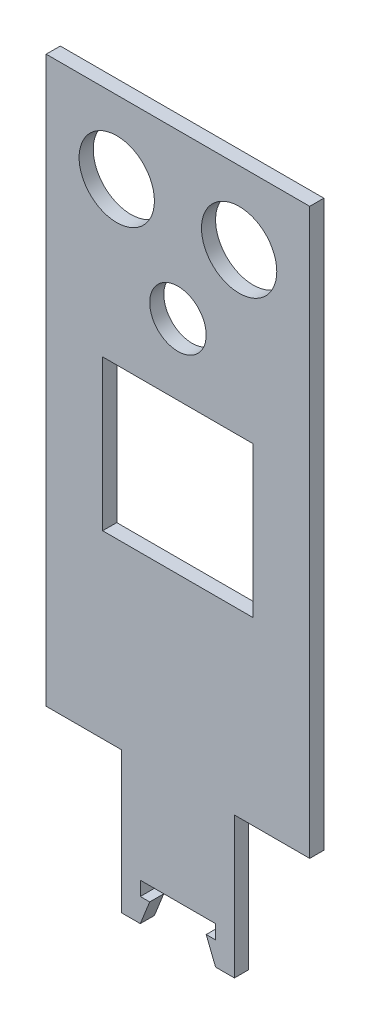
ISO-10303-21;
HEADER;
FILE_DESCRIPTION(('STEP AP214'),'2;1');
FILE_NAME('part.step','',(''),(''),'','','');
FILE_SCHEMA(('AUTOMOTIVE_DESIGN { 1 0 10303 214 1 1 1 1 }'));
ENDSEC;
DATA;
#1=APPLICATION_CONTEXT('core data for automotive mechanical design processes');
#2=APPLICATION_PROTOCOL_DEFINITION('international standard','automotive_design',2000,#1);
#3=PRODUCT_CONTEXT('',#1,'mechanical');
#4=PRODUCT('Part','Part','',(#3));
#5=PRODUCT_RELATED_PRODUCT_CATEGORY('part','',(#4));
#6=PRODUCT_DEFINITION_FORMATION('','',#4);
#7=PRODUCT_DEFINITION_CONTEXT('part definition',#1,'design');
#8=PRODUCT_DEFINITION('design','',#6,#7);
#9=PRODUCT_DEFINITION_SHAPE('','',#8);
#10=(LENGTH_UNIT() NAMED_UNIT(*) SI_UNIT(.MILLI.,.METRE.));
#11=(NAMED_UNIT(*) PLANE_ANGLE_UNIT() SI_UNIT($,.RADIAN.));
#12=(NAMED_UNIT(*) SI_UNIT($,.STERADIAN.) SOLID_ANGLE_UNIT());
#13=UNCERTAINTY_MEASURE_WITH_UNIT(LENGTH_MEASURE(1.E-05),#10,'distance_accuracy_value','');
#14=(GEOMETRIC_REPRESENTATION_CONTEXT(3) GLOBAL_UNCERTAINTY_ASSIGNED_CONTEXT((#13)) GLOBAL_UNIT_ASSIGNED_CONTEXT((#10,
#11,#12)) REPRESENTATION_CONTEXT('',''));
#15=CARTESIAN_POINT('',(0.,0.,0.));
#16=DIRECTION('',(0.,0.,1.));
#17=DIRECTION('',(1.,0.,0.));
#18=AXIS2_PLACEMENT_3D('',#15,#16,#17);
#19=CARTESIAN_POINT('',(0.,0.,3.));
#20=DIRECTION('',(0.,0.,1.));
#21=DIRECTION('',(1.,0.,0.));
#22=AXIS2_PLACEMENT_3D('',#19,#20,#21);
#23=PLANE('',#22);
#24=CARTESIAN_POINT('',(-22.41749108736,76.63301660672,3.));
#25=DIRECTION('',(0.,0.,1.));
#26=DIRECTION('',(1.,0.,0.));
#27=AXIS2_PLACEMENT_3D('',#24,#25,#26);
#28=CIRCLE('',#27,8.);
#29=CARTESIAN_POINT('',(-14.41749108736,76.63301660672,3.));
#30=VERTEX_POINT('',#29);
#31=EDGE_CURVE('E212',#30,#30,#28,.T.);
#32=ORIENTED_EDGE('',*,*,#31,.F.);
#33=EDGE_LOOP('',(#32));
#34=FACE_BOUND('',#33,.T.);
#35=DIRECTION('',(-1.,0.,0.));
#36=VECTOR('',#35,1.);
#37=CARTESIAN_POINT('',(18.58250891264,92.13301660672,3.));
#38=LINE('',#37,#36);
#39=CARTESIAN_POINT('',(18.58250891264,92.13301660672,3.));
#40=VERTEX_POINT('',#39);
#41=CARTESIAN_POINT('',(-37.41749108736,92.13301660672,3.));
#42=VERTEX_POINT('',#41);
#43=EDGE_CURVE('E224',#40,#42,#38,.T.);
#44=ORIENTED_EDGE('',*,*,#43,.T.);
#45=DIRECTION('',(0.,-1.,0.));
#46=VECTOR('',#45,1.);
#47=CARTESIAN_POINT('',(-37.41749108736,92.13301660672,3.));
#48=LINE('',#47,#46);
#49=CARTESIAN_POINT('',(-37.41749108736,-27.86698339328,3.));
#50=VERTEX_POINT('',#49);
#51=EDGE_CURVE('E227',#42,#50,#48,.T.);
#52=ORIENTED_EDGE('',*,*,#51,.T.);
#53=DIRECTION('',(1.,0.,0.));
#54=VECTOR('',#53,1.);
#55=CARTESIAN_POINT('',(-37.41749108736,-27.86698339328,3.));
#56=LINE('',#55,#54);
#57=CARTESIAN_POINT('',(-21.4174910873601,-27.86698339328,3.));
#58=VERTEX_POINT('',#57);
#59=EDGE_CURVE('E230',#50,#58,#56,.T.);
#60=ORIENTED_EDGE('',*,*,#59,.T.);
#61=DIRECTION('',(0.,-1.,0.));
#62=VECTOR('',#61,1.);
#63=CARTESIAN_POINT('',(-21.4174910873601,-27.86698339328,3.));
#64=LINE('',#63,#62);
#65=CARTESIAN_POINT('',(-21.4174910873601,-57.86698339328,3.));
#66=VERTEX_POINT('',#65);
#67=EDGE_CURVE('E232',#58,#66,#64,.T.);
#68=ORIENTED_EDGE('',*,*,#67,.T.);
#69=DIRECTION('',(1.,0.,0.));
#70=VECTOR('',#69,1.);
#71=CARTESIAN_POINT('',(-21.4174910873601,-57.86698339328,3.));
#72=LINE('',#71,#70);
#73=CARTESIAN_POINT('',(-17.4174910873601,-57.86698339328,3.));
#74=VERTEX_POINT('',#73);
#75=EDGE_CURVE('E234',#66,#74,#72,.T.);
#76=ORIENTED_EDGE('',*,*,#75,.T.);
#77=DIRECTION('',(0.371390676354104,0.928476690885259,0.));
#78=VECTOR('',#77,1.);
#79=CARTESIAN_POINT('',(-17.4174910873601,-57.86698339328,3.));
#80=LINE('',#79,#78);
#81=CARTESIAN_POINT('',(-15.41749108736,-52.86698339328,3.));
#82=VERTEX_POINT('',#81);
#83=EDGE_CURVE('E236',#74,#82,#80,.T.);
#84=ORIENTED_EDGE('',*,*,#83,.T.);
#85=DIRECTION('',(-1.,0.,0.));
#86=VECTOR('',#85,1.);
#87=CARTESIAN_POINT('',(-15.41749108736,-52.86698339328,3.));
#88=LINE('',#87,#86);
#89=CARTESIAN_POINT('',(-17.4174910873601,-52.86698339328,3.));
#90=VERTEX_POINT('',#89);
#91=EDGE_CURVE('E238',#82,#90,#88,.T.);
#92=ORIENTED_EDGE('',*,*,#91,.T.);
#93=DIRECTION('',(0.,1.,0.));
#94=VECTOR('',#93,1.);
#95=CARTESIAN_POINT('',(-17.4174910873601,-52.86698339328,3.));
#96=LINE('',#95,#94);
#97=CARTESIAN_POINT('',(-17.4174910873601,-49.86698339328,3.));
#98=VERTEX_POINT('',#97);
#99=EDGE_CURVE('E240',#90,#98,#96,.T.);
#100=ORIENTED_EDGE('',*,*,#99,.T.);
#101=DIRECTION('',(1.,0.,0.));
#102=VECTOR('',#101,1.);
#103=CARTESIAN_POINT('',(-17.4174910873601,-49.86698339328,3.));
#104=LINE('',#103,#102);
#105=CARTESIAN_POINT('',(-1.41749108736005,-49.86698339328,3.));
#106=VERTEX_POINT('',#105);
#107=EDGE_CURVE('E242',#98,#106,#104,.T.);
#108=ORIENTED_EDGE('',*,*,#107,.T.);
#109=DIRECTION('',(0.,-1.,0.));
#110=VECTOR('',#109,1.);
#111=CARTESIAN_POINT('',(-1.41749108736005,-49.86698339328,3.));
#112=LINE('',#111,#110);
#113=CARTESIAN_POINT('',(-1.41749108736005,-52.86698339328,3.));
#114=VERTEX_POINT('',#113);
#115=EDGE_CURVE('E244',#106,#114,#112,.T.);
#116=ORIENTED_EDGE('',*,*,#115,.T.);
#117=DIRECTION('',(-1.,0.,0.));
#118=VECTOR('',#117,1.);
#119=CARTESIAN_POINT('',(-1.41749108736005,-52.86698339328,3.));
#120=LINE('',#119,#118);
#121=CARTESIAN_POINT('',(-3.41749108736005,-52.86698339328,3.));
#122=VERTEX_POINT('',#121);
#123=EDGE_CURVE('E246',#114,#122,#120,.T.);
#124=ORIENTED_EDGE('',*,*,#123,.T.);
#125=DIRECTION('',(0.371390676354104,-0.928476690885259,0.));
#126=VECTOR('',#125,1.);
#127=CARTESIAN_POINT('',(-3.41749108736005,-52.86698339328,3.));
#128=LINE('',#127,#126);
#129=CARTESIAN_POINT('',(-1.41749108736005,-57.86698339328,3.));
#130=VERTEX_POINT('',#129);
#131=EDGE_CURVE('E248',#122,#130,#128,.T.);
#132=ORIENTED_EDGE('',*,*,#131,.T.);
#133=DIRECTION('',(1.,0.,0.));
#134=VECTOR('',#133,1.);
#135=CARTESIAN_POINT('',(-1.41749108736005,-57.86698339328,3.));
#136=LINE('',#135,#134);
#137=CARTESIAN_POINT('',(2.58250891263995,-57.86698339328,3.));
#138=VERTEX_POINT('',#137);
#139=EDGE_CURVE('E250',#130,#138,#136,.T.);
#140=ORIENTED_EDGE('',*,*,#139,.T.);
#141=DIRECTION('',(0.,1.,0.));
#142=VECTOR('',#141,1.);
#143=CARTESIAN_POINT('',(2.58250891263995,-57.86698339328,3.));
#144=LINE('',#143,#142);
#145=CARTESIAN_POINT('',(2.58250891263995,-27.86698339328,3.));
#146=VERTEX_POINT('',#145);
#147=EDGE_CURVE('E252',#138,#146,#144,.T.);
#148=ORIENTED_EDGE('',*,*,#147,.T.);
#149=DIRECTION('',(1.,0.,0.));
#150=VECTOR('',#149,1.);
#151=CARTESIAN_POINT('',(2.58250891263995,-27.86698339328,3.));
#152=LINE('',#151,#150);
#153=CARTESIAN_POINT('',(18.58250891264,-27.86698339328,3.));
#154=VERTEX_POINT('',#153);
#155=EDGE_CURVE('E254',#146,#154,#152,.T.);
#156=ORIENTED_EDGE('',*,*,#155,.T.);
#157=DIRECTION('',(0.,1.,0.));
#158=VECTOR('',#157,1.);
#159=CARTESIAN_POINT('',(18.58250891264,92.13301660672,3.));
#160=LINE('',#159,#158);
#161=EDGE_CURVE('E256',#154,#40,#160,.T.);
#162=ORIENTED_EDGE('',*,*,#161,.T.);
#163=EDGE_LOOP('',(#44,#52,#60,#68,#76,#84,#92,#100,#108,#116,#124,#132,#140,#148,#156,#162));
#164=FACE_BOUND('',#163,.T.);
#165=CARTESIAN_POINT('',(-9.41749108736005,57.43301660672,3.));
#166=DIRECTION('',(0.,0.,1.));
#167=DIRECTION('',(1.,0.,0.));
#168=AXIS2_PLACEMENT_3D('',#165,#166,#167);
#169=CIRCLE('',#168,6.);
#170=CARTESIAN_POINT('',(-3.41749108736005,57.43301660672,3.));
#171=VERTEX_POINT('',#170);
#172=EDGE_CURVE('E218',#171,#171,#169,.T.);
#173=ORIENTED_EDGE('',*,*,#172,.F.);
#174=EDGE_LOOP('',(#173));
#175=FACE_BOUND('',#174,.T.);
#176=CARTESIAN_POINT('',(3.58250891263995,76.63301660672,3.));
#177=DIRECTION('',(0.,0.,1.));
#178=DIRECTION('',(1.,0.,0.));
#179=AXIS2_PLACEMENT_3D('',#176,#177,#178);
#180=CIRCLE('',#179,8.);
#181=CARTESIAN_POINT('',(11.58250891264,76.63301660672,3.));
#182=VERTEX_POINT('',#181);
#183=EDGE_CURVE('E206',#182,#182,#180,.T.);
#184=ORIENTED_EDGE('',*,*,#183,.F.);
#185=EDGE_LOOP('',(#184));
#186=FACE_BOUND('',#185,.T.);
#187=DIRECTION('',(0.,-1.,0.));
#188=VECTOR('',#187,1.);
#189=CARTESIAN_POINT('',(-25.4174910873601,10.43301660672,3.));
#190=LINE('',#189,#188);
#191=CARTESIAN_POINT('',(-25.4174910873601,42.43301660672,3.));
#192=VERTEX_POINT('',#191);
#193=CARTESIAN_POINT('',(-25.4174910873601,10.43301660672,3.));
#194=VERTEX_POINT('',#193);
#195=EDGE_CURVE('E178',#192,#194,#190,.T.);
#196=ORIENTED_EDGE('',*,*,#195,.F.);
#197=DIRECTION('',(-1.,0.,0.));
#198=VECTOR('',#197,1.);
#199=CARTESIAN_POINT('',(-25.4174910873601,42.43301660672,3.));
#200=LINE('',#199,#198);
#201=CARTESIAN_POINT('',(6.58250891263995,42.43301660672,3.));
#202=VERTEX_POINT('',#201);
#203=EDGE_CURVE('E170',#202,#192,#200,.T.);
#204=ORIENTED_EDGE('',*,*,#203,.F.);
#205=DIRECTION('',(0.,1.,0.));
#206=VECTOR('',#205,1.);
#207=CARTESIAN_POINT('',(6.58250891263995,42.43301660672,3.));
#208=LINE('',#207,#206);
#209=CARTESIAN_POINT('',(6.58250891263995,10.43301660672,3.));
#210=VERTEX_POINT('',#209);
#211=EDGE_CURVE('E192',#210,#202,#208,.T.);
#212=ORIENTED_EDGE('',*,*,#211,.F.);
#213=DIRECTION('',(1.,0.,0.));
#214=VECTOR('',#213,1.);
#215=CARTESIAN_POINT('',(6.58250891263995,10.43301660672,3.));
#216=LINE('',#215,#214);
#217=EDGE_CURVE('E190',#194,#210,#216,.T.);
#218=ORIENTED_EDGE('',*,*,#217,.F.);
#219=EDGE_LOOP('',(#196,#204,#212,#218));
#220=FACE_BOUND('',#219,.T.);
#221=ADVANCED_FACE('F33',(#34,#164,#175,#186,#220),#23,.T.);
#222=CARTESIAN_POINT('',(0.,0.,0.));
#223=DIRECTION('',(0.,0.,1.));
#224=DIRECTION('',(1.,0.,0.));
#225=AXIS2_PLACEMENT_3D('',#222,#223,#224);
#226=PLANE('',#225);
#227=CARTESIAN_POINT('',(3.58250891263995,76.63301660672,0.));
#228=DIRECTION('',(0.,0.,1.));
#229=DIRECTION('',(1.,0.,0.));
#230=AXIS2_PLACEMENT_3D('',#227,#228,#229);
#231=CIRCLE('',#230,8.);
#232=CARTESIAN_POINT('',(11.58250891264,76.63301660672,0.));
#233=VERTEX_POINT('',#232);
#234=EDGE_CURVE('E186',#233,#233,#231,.T.);
#235=ORIENTED_EDGE('',*,*,#234,.T.);
#236=EDGE_LOOP('',(#235));
#237=FACE_BOUND('',#236,.T.);
#238=CARTESIAN_POINT('',(-22.41749108736,76.63301660672,0.));
#239=DIRECTION('',(0.,0.,1.));
#240=DIRECTION('',(1.,0.,0.));
#241=AXIS2_PLACEMENT_3D('',#238,#239,#240);
#242=CIRCLE('',#241,8.);
#243=CARTESIAN_POINT('',(-14.41749108736,76.63301660672,0.));
#244=VERTEX_POINT('',#243);
#245=EDGE_CURVE('E209',#244,#244,#242,.T.);
#246=ORIENTED_EDGE('',*,*,#245,.T.);
#247=EDGE_LOOP('',(#246));
#248=FACE_BOUND('',#247,.T.);
#249=CARTESIAN_POINT('',(-9.41749108736005,57.43301660672,0.));
#250=DIRECTION('',(0.,0.,1.));
#251=DIRECTION('',(1.,0.,0.));
#252=AXIS2_PLACEMENT_3D('',#249,#250,#251);
#253=CIRCLE('',#252,6.);
#254=CARTESIAN_POINT('',(-3.41749108736005,57.43301660672,0.));
#255=VERTEX_POINT('',#254);
#256=EDGE_CURVE('E215',#255,#255,#253,.T.);
#257=ORIENTED_EDGE('',*,*,#256,.T.);
#258=EDGE_LOOP('',(#257));
#259=FACE_BOUND('',#258,.T.);
#260=DIRECTION('',(-1.,0.,0.));
#261=VECTOR('',#260,1.);
#262=CARTESIAN_POINT('',(18.58250891264,92.13301660672,0.));
#263=LINE('',#262,#261);
#264=CARTESIAN_POINT('',(18.58250891264,92.13301660672,0.));
#265=VERTEX_POINT('',#264);
#266=CARTESIAN_POINT('',(-37.41749108736,92.13301660672,0.));
#267=VERTEX_POINT('',#266);
#268=EDGE_CURVE('E221',#265,#267,#263,.T.);
#269=ORIENTED_EDGE('',*,*,#268,.F.);
#270=DIRECTION('',(0.,1.,0.));
#271=VECTOR('',#270,1.);
#272=CARTESIAN_POINT('',(18.58250891264,92.13301660672,0.));
#273=LINE('',#272,#271);
#274=CARTESIAN_POINT('',(18.58250891264,-27.86698339328,0.));
#275=VERTEX_POINT('',#274);
#276=EDGE_CURVE('E228',#275,#265,#273,.T.);
#277=ORIENTED_EDGE('',*,*,#276,.F.);
#278=DIRECTION('',(1.,0.,0.));
#279=VECTOR('',#278,1.);
#280=CARTESIAN_POINT('',(2.58250891263995,-27.86698339328,0.));
#281=LINE('',#280,#279);
#282=CARTESIAN_POINT('',(2.58250891263995,-27.86698339328,0.));
#283=VERTEX_POINT('',#282);
#284=EDGE_CURVE('E287',#283,#275,#281,.T.);
#285=ORIENTED_EDGE('',*,*,#284,.F.);
#286=DIRECTION('',(0.,1.,0.));
#287=VECTOR('',#286,1.);
#288=CARTESIAN_POINT('',(2.58250891263995,-57.86698339328,0.));
#289=LINE('',#288,#287);
#290=CARTESIAN_POINT('',(2.58250891263995,-57.86698339328,0.));
#291=VERTEX_POINT('',#290);
#292=EDGE_CURVE('E285',#291,#283,#289,.T.);
#293=ORIENTED_EDGE('',*,*,#292,.F.);
#294=DIRECTION('',(1.,0.,0.));
#295=VECTOR('',#294,1.);
#296=CARTESIAN_POINT('',(-1.41749108736005,-57.86698339328,0.));
#297=LINE('',#296,#295);
#298=CARTESIAN_POINT('',(-1.41749108736005,-57.86698339328,0.));
#299=VERTEX_POINT('',#298);
#300=EDGE_CURVE('E283',#299,#291,#297,.T.);
#301=ORIENTED_EDGE('',*,*,#300,.F.);
#302=DIRECTION('',(0.371390676354104,-0.928476690885259,0.));
#303=VECTOR('',#302,1.);
#304=CARTESIAN_POINT('',(-3.41749108736005,-52.86698339328,0.));
#305=LINE('',#304,#303);
#306=CARTESIAN_POINT('',(-3.41749108736005,-52.86698339328,0.));
#307=VERTEX_POINT('',#306);
#308=EDGE_CURVE('E281',#307,#299,#305,.T.);
#309=ORIENTED_EDGE('',*,*,#308,.F.);
#310=DIRECTION('',(-1.,0.,0.));
#311=VECTOR('',#310,1.);
#312=CARTESIAN_POINT('',(-1.41749108736005,-52.86698339328,0.));
#313=LINE('',#312,#311);
#314=CARTESIAN_POINT('',(-1.41749108736005,-52.86698339328,0.));
#315=VERTEX_POINT('',#314);
#316=EDGE_CURVE('E279',#315,#307,#313,.T.);
#317=ORIENTED_EDGE('',*,*,#316,.F.);
#318=DIRECTION('',(0.,-1.,0.));
#319=VECTOR('',#318,1.);
#320=CARTESIAN_POINT('',(-1.41749108736005,-49.86698339328,0.));
#321=LINE('',#320,#319);
#322=CARTESIAN_POINT('',(-1.41749108736005,-49.86698339328,0.));
#323=VERTEX_POINT('',#322);
#324=EDGE_CURVE('E277',#323,#315,#321,.T.);
#325=ORIENTED_EDGE('',*,*,#324,.F.);
#326=DIRECTION('',(1.,0.,0.));
#327=VECTOR('',#326,1.);
#328=CARTESIAN_POINT('',(-17.4174910873601,-49.86698339328,0.));
#329=LINE('',#328,#327);
#330=CARTESIAN_POINT('',(-17.4174910873601,-49.86698339328,0.));
#331=VERTEX_POINT('',#330);
#332=EDGE_CURVE('E275',#331,#323,#329,.T.);
#333=ORIENTED_EDGE('',*,*,#332,.F.);
#334=DIRECTION('',(0.,1.,0.));
#335=VECTOR('',#334,1.);
#336=CARTESIAN_POINT('',(-17.4174910873601,-52.86698339328,0.));
#337=LINE('',#336,#335);
#338=CARTESIAN_POINT('',(-17.4174910873601,-52.86698339328,0.));
#339=VERTEX_POINT('',#338);
#340=EDGE_CURVE('E273',#339,#331,#337,.T.);
#341=ORIENTED_EDGE('',*,*,#340,.F.);
#342=DIRECTION('',(-1.,0.,0.));
#343=VECTOR('',#342,1.);
#344=CARTESIAN_POINT('',(-15.41749108736,-52.86698339328,0.));
#345=LINE('',#344,#343);
#346=CARTESIAN_POINT('',(-15.41749108736,-52.86698339328,0.));
#347=VERTEX_POINT('',#346);
#348=EDGE_CURVE('E271',#347,#339,#345,.T.);
#349=ORIENTED_EDGE('',*,*,#348,.F.);
#350=DIRECTION('',(0.371390676354104,0.928476690885259,0.));
#351=VECTOR('',#350,1.);
#352=CARTESIAN_POINT('',(-17.4174910873601,-57.86698339328,0.));
#353=LINE('',#352,#351);
#354=CARTESIAN_POINT('',(-17.4174910873601,-57.86698339328,0.));
#355=VERTEX_POINT('',#354);
#356=EDGE_CURVE('E269',#355,#347,#353,.T.);
#357=ORIENTED_EDGE('',*,*,#356,.F.);
#358=DIRECTION('',(1.,0.,0.));
#359=VECTOR('',#358,1.);
#360=CARTESIAN_POINT('',(-21.4174910873601,-57.86698339328,0.));
#361=LINE('',#360,#359);
#362=CARTESIAN_POINT('',(-21.4174910873601,-57.86698339328,0.));
#363=VERTEX_POINT('',#362);
#364=EDGE_CURVE('E267',#363,#355,#361,.T.);
#365=ORIENTED_EDGE('',*,*,#364,.F.);
#366=DIRECTION('',(0.,-1.,0.));
#367=VECTOR('',#366,1.);
#368=CARTESIAN_POINT('',(-21.4174910873601,-27.86698339328,0.));
#369=LINE('',#368,#367);
#370=CARTESIAN_POINT('',(-21.4174910873601,-27.86698339328,0.));
#371=VERTEX_POINT('',#370);
#372=EDGE_CURVE('E265',#371,#363,#369,.T.);
#373=ORIENTED_EDGE('',*,*,#372,.F.);
#374=DIRECTION('',(1.,0.,0.));
#375=VECTOR('',#374,1.);
#376=CARTESIAN_POINT('',(-37.41749108736,-27.86698339328,0.));
#377=LINE('',#376,#375);
#378=CARTESIAN_POINT('',(-37.41749108736,-27.86698339328,0.));
#379=VERTEX_POINT('',#378);
#380=EDGE_CURVE('E263',#379,#371,#377,.T.);
#381=ORIENTED_EDGE('',*,*,#380,.F.);
#382=DIRECTION('',(0.,-1.,0.));
#383=VECTOR('',#382,1.);
#384=CARTESIAN_POINT('',(-37.41749108736,92.13301660672,0.));
#385=LINE('',#384,#383);
#386=EDGE_CURVE('E261',#267,#379,#385,.T.);
#387=ORIENTED_EDGE('',*,*,#386,.F.);
#388=EDGE_LOOP('',(#269,#277,#285,#293,#301,#309,#317,#325,#333,#341,#349,#357,#365,#373,#381,#387));
#389=FACE_BOUND('',#388,.T.);
#390=DIRECTION('',(-1.,0.,0.));
#391=VECTOR('',#390,1.);
#392=CARTESIAN_POINT('',(-25.4174910873601,42.43301660672,0.));
#393=LINE('',#392,#391);
#394=CARTESIAN_POINT('',(6.58250891263995,42.43301660672,0.));
#395=VERTEX_POINT('',#394);
#396=CARTESIAN_POINT('',(-25.4174910873601,42.43301660672,0.));
#397=VERTEX_POINT('',#396);
#398=EDGE_CURVE('E56',#395,#397,#393,.T.);
#399=ORIENTED_EDGE('',*,*,#398,.T.);
#400=DIRECTION('',(0.,-1.,0.));
#401=VECTOR('',#400,1.);
#402=CARTESIAN_POINT('',(-25.4174910873601,10.43301660672,0.));
#403=LINE('',#402,#401);
#404=CARTESIAN_POINT('',(-25.4174910873601,10.43301660672,0.));
#405=VERTEX_POINT('',#404);
#406=EDGE_CURVE('E185',#397,#405,#403,.T.);
#407=ORIENTED_EDGE('',*,*,#406,.T.);
#408=DIRECTION('',(1.,0.,0.));
#409=VECTOR('',#408,1.);
#410=CARTESIAN_POINT('',(6.58250891263995,10.43301660672,0.));
#411=LINE('',#410,#409);
#412=CARTESIAN_POINT('',(6.58250891263995,10.43301660672,0.));
#413=VERTEX_POINT('',#412);
#414=EDGE_CURVE('E198',#405,#413,#411,.T.);
#415=ORIENTED_EDGE('',*,*,#414,.T.);
#416=DIRECTION('',(0.,1.,0.));
#417=VECTOR('',#416,1.);
#418=CARTESIAN_POINT('',(6.58250891263995,42.43301660672,0.));
#419=LINE('',#418,#417);
#420=EDGE_CURVE('E179',#413,#395,#419,.T.);
#421=ORIENTED_EDGE('',*,*,#420,.T.);
#422=EDGE_LOOP('',(#399,#407,#415,#421));
#423=FACE_BOUND('',#422,.T.);
#424=ADVANCED_FACE('F341',(#237,#248,#259,#389,#423),#226,.F.);
#425=CARTESIAN_POINT('',(18.58250891264,92.13301660672,3.));
#426=DIRECTION('',(0.,-1.,0.));
#427=DIRECTION('',(0.,0.,-1.));
#428=AXIS2_PLACEMENT_3D('',#425,#426,#427);
#429=PLANE('',#428);
#430=ORIENTED_EDGE('',*,*,#268,.T.);
#431=DIRECTION('',(0.,0.,-1.));
#432=VECTOR('',#431,1.);
#433=CARTESIAN_POINT('',(-37.41749108736,92.13301660672,3.));
#434=LINE('',#433,#432);
#435=EDGE_CURVE('E11',#42,#267,#434,.T.);
#436=ORIENTED_EDGE('',*,*,#435,.F.);
#437=ORIENTED_EDGE('',*,*,#43,.F.);
#438=DIRECTION('',(0.,0.,-1.));
#439=VECTOR('',#438,1.);
#440=CARTESIAN_POINT('',(18.58250891264,92.13301660672,3.));
#441=LINE('',#440,#439);
#442=EDGE_CURVE('E258',#40,#265,#441,.T.);
#443=ORIENTED_EDGE('',*,*,#442,.T.);
#444=EDGE_LOOP('',(#430,#436,#437,#443));
#445=FACE_BOUND('',#444,.T.);
#446=ADVANCED_FACE('F35',(#445),#429,.F.);
#447=CARTESIAN_POINT('',(-37.41749108736,92.13301660672,3.));
#448=DIRECTION('',(1.,0.,0.));
#449=DIRECTION('',(0.,0.,-1.));
#450=AXIS2_PLACEMENT_3D('',#447,#448,#449);
#451=PLANE('',#450);
#452=ORIENTED_EDGE('',*,*,#386,.T.);
#453=DIRECTION('',(0.,0.,-1.));
#454=VECTOR('',#453,1.);
#455=CARTESIAN_POINT('',(-37.41749108736,-27.86698339328,3.));
#456=LINE('',#455,#454);
#457=EDGE_CURVE('E41',#50,#379,#456,.T.);
#458=ORIENTED_EDGE('',*,*,#457,.F.);
#459=ORIENTED_EDGE('',*,*,#51,.F.);
#460=ORIENTED_EDGE('',*,*,#435,.T.);
#461=EDGE_LOOP('',(#452,#458,#459,#460));
#462=FACE_BOUND('',#461,.T.);
#463=ADVANCED_FACE('F359',(#462),#451,.F.);
#464=CARTESIAN_POINT('',(-37.41749108736,-27.86698339328,3.));
#465=DIRECTION('',(0.,1.,0.));
#466=DIRECTION('',(0.,0.,1.));
#467=AXIS2_PLACEMENT_3D('',#464,#465,#466);
#468=PLANE('',#467);
#469=ORIENTED_EDGE('',*,*,#380,.T.);
#470=DIRECTION('',(0.,0.,-1.));
#471=VECTOR('',#470,1.);
#472=CARTESIAN_POINT('',(-21.4174910873601,-27.86698339328,3.));
#473=LINE('',#472,#471);
#474=EDGE_CURVE('E328',#58,#371,#473,.T.);
#475=ORIENTED_EDGE('',*,*,#474,.F.);
#476=ORIENTED_EDGE('',*,*,#59,.F.);
#477=ORIENTED_EDGE('',*,*,#457,.T.);
#478=EDGE_LOOP('',(#469,#475,#476,#477));
#479=FACE_BOUND('',#478,.T.);
#480=ADVANCED_FACE('F335',(#479),#468,.F.);
#481=CARTESIAN_POINT('',(-21.4174910873601,-27.86698339328,3.));
#482=DIRECTION('',(1.,0.,0.));
#483=DIRECTION('',(0.,0.,-1.));
#484=AXIS2_PLACEMENT_3D('',#481,#482,#483);
#485=PLANE('',#484);
#486=ORIENTED_EDGE('',*,*,#372,.T.);
#487=DIRECTION('',(0.,0.,-1.));
#488=VECTOR('',#487,1.);
#489=CARTESIAN_POINT('',(-21.4174910873601,-57.86698339328,3.));
#490=LINE('',#489,#488);
#491=EDGE_CURVE('E325',#66,#363,#490,.T.);
#492=ORIENTED_EDGE('',*,*,#491,.F.);
#493=ORIENTED_EDGE('',*,*,#67,.F.);
#494=ORIENTED_EDGE('',*,*,#474,.T.);
#495=EDGE_LOOP('',(#486,#492,#493,#494));
#496=FACE_BOUND('',#495,.T.);
#497=ADVANCED_FACE('F347',(#496),#485,.F.);
#498=CARTESIAN_POINT('',(-21.4174910873601,-57.86698339328,3.));
#499=DIRECTION('',(0.,1.,0.));
#500=DIRECTION('',(0.,0.,1.));
#501=AXIS2_PLACEMENT_3D('',#498,#499,#500);
#502=PLANE('',#501);
#503=ORIENTED_EDGE('',*,*,#364,.T.);
#504=DIRECTION('',(0.,0.,-1.));
#505=VECTOR('',#504,1.);
#506=CARTESIAN_POINT('',(-17.4174910873601,-57.86698339328,3.));
#507=LINE('',#506,#505);
#508=EDGE_CURVE('E322',#74,#355,#507,.T.);
#509=ORIENTED_EDGE('',*,*,#508,.F.);
#510=ORIENTED_EDGE('',*,*,#75,.F.);
#511=ORIENTED_EDGE('',*,*,#491,.T.);
#512=EDGE_LOOP('',(#503,#509,#510,#511));
#513=FACE_BOUND('',#512,.T.);
#514=ADVANCED_FACE('F351',(#513),#502,.F.);
#515=CARTESIAN_POINT('',(-17.4174910873601,-57.86698339328,3.));
#516=DIRECTION('',(-0.928476690885259,0.371390676354104,0.));
#517=DIRECTION('',(-0.371390676354104,-0.928476690885259,0.));
#518=AXIS2_PLACEMENT_3D('',#515,#516,#517);
#519=PLANE('',#518);
#520=ORIENTED_EDGE('',*,*,#356,.T.);
#521=DIRECTION('',(0.,0.,-1.));
#522=VECTOR('',#521,1.);
#523=CARTESIAN_POINT('',(-15.41749108736,-52.86698339328,3.));
#524=LINE('',#523,#522);
#525=EDGE_CURVE('E319',#82,#347,#524,.T.);
#526=ORIENTED_EDGE('',*,*,#525,.F.);
#527=ORIENTED_EDGE('',*,*,#83,.F.);
#528=ORIENTED_EDGE('',*,*,#508,.T.);
#529=EDGE_LOOP('',(#520,#526,#527,#528));
#530=FACE_BOUND('',#529,.T.);
#531=ADVANCED_FACE('F412',(#530),#519,.F.);
#532=CARTESIAN_POINT('',(-15.41749108736,-52.86698339328,3.));
#533=DIRECTION('',(0.,-1.,0.));
#534=DIRECTION('',(0.,0.,-1.));
#535=AXIS2_PLACEMENT_3D('',#532,#533,#534);
#536=PLANE('',#535);
#537=ORIENTED_EDGE('',*,*,#348,.T.);
#538=DIRECTION('',(0.,0.,-1.));
#539=VECTOR('',#538,1.);
#540=CARTESIAN_POINT('',(-17.4174910873601,-52.86698339328,3.));
#541=LINE('',#540,#539);
#542=EDGE_CURVE('E316',#90,#339,#541,.T.);
#543=ORIENTED_EDGE('',*,*,#542,.F.);
#544=ORIENTED_EDGE('',*,*,#91,.F.);
#545=ORIENTED_EDGE('',*,*,#525,.T.);
#546=EDGE_LOOP('',(#537,#543,#544,#545));
#547=FACE_BOUND('',#546,.T.);
#548=ADVANCED_FACE('F409',(#547),#536,.F.);
#549=CARTESIAN_POINT('',(-17.4174910873601,-52.86698339328,3.));
#550=DIRECTION('',(-1.,0.,0.));
#551=DIRECTION('',(0.,0.,1.));
#552=AXIS2_PLACEMENT_3D('',#549,#550,#551);
#553=PLANE('',#552);
#554=ORIENTED_EDGE('',*,*,#340,.T.);
#555=DIRECTION('',(0.,0.,-1.));
#556=VECTOR('',#555,1.);
#557=CARTESIAN_POINT('',(-17.4174910873601,-49.86698339328,3.));
#558=LINE('',#557,#556);
#559=EDGE_CURVE('E313',#98,#331,#558,.T.);
#560=ORIENTED_EDGE('',*,*,#559,.F.);
#561=ORIENTED_EDGE('',*,*,#99,.F.);
#562=ORIENTED_EDGE('',*,*,#542,.T.);
#563=EDGE_LOOP('',(#554,#560,#561,#562));
#564=FACE_BOUND('',#563,.T.);
#565=ADVANCED_FACE('F405',(#564),#553,.F.);
#566=CARTESIAN_POINT('',(-17.4174910873601,-49.86698339328,3.));
#567=DIRECTION('',(0.,1.,0.));
#568=DIRECTION('',(0.,0.,1.));
#569=AXIS2_PLACEMENT_3D('',#566,#567,#568);
#570=PLANE('',#569);
#571=ORIENTED_EDGE('',*,*,#332,.T.);
#572=DIRECTION('',(0.,0.,-1.));
#573=VECTOR('',#572,1.);
#574=CARTESIAN_POINT('',(-1.41749108736005,-49.86698339328,3.));
#575=LINE('',#574,#573);
#576=EDGE_CURVE('E310',#106,#323,#575,.T.);
#577=ORIENTED_EDGE('',*,*,#576,.F.);
#578=ORIENTED_EDGE('',*,*,#107,.F.);
#579=ORIENTED_EDGE('',*,*,#559,.T.);
#580=EDGE_LOOP('',(#571,#577,#578,#579));
#581=FACE_BOUND('',#580,.T.);
#582=ADVANCED_FACE('F401',(#581),#570,.F.);
#583=CARTESIAN_POINT('',(-1.41749108736005,-49.86698339328,3.));
#584=DIRECTION('',(1.,0.,0.));
#585=DIRECTION('',(0.,0.,-1.));
#586=AXIS2_PLACEMENT_3D('',#583,#584,#585);
#587=PLANE('',#586);
#588=ORIENTED_EDGE('',*,*,#324,.T.);
#589=DIRECTION('',(0.,0.,-1.));
#590=VECTOR('',#589,1.);
#591=CARTESIAN_POINT('',(-1.41749108736005,-52.86698339328,3.));
#592=LINE('',#591,#590);
#593=EDGE_CURVE('E307',#114,#315,#592,.T.);
#594=ORIENTED_EDGE('',*,*,#593,.F.);
#595=ORIENTED_EDGE('',*,*,#115,.F.);
#596=ORIENTED_EDGE('',*,*,#576,.T.);
#597=EDGE_LOOP('',(#588,#594,#595,#596));
#598=FACE_BOUND('',#597,.T.);
#599=ADVANCED_FACE('F396',(#598),#587,.F.);
#600=CARTESIAN_POINT('',(-1.41749108736005,-52.86698339328,3.));
#601=DIRECTION('',(0.,-1.,0.));
#602=DIRECTION('',(0.,0.,-1.));
#603=AXIS2_PLACEMENT_3D('',#600,#601,#602);
#604=PLANE('',#603);
#605=ORIENTED_EDGE('',*,*,#316,.T.);
#606=DIRECTION('',(0.,0.,-1.));
#607=VECTOR('',#606,1.);
#608=CARTESIAN_POINT('',(-3.41749108736005,-52.86698339328,3.));
#609=LINE('',#608,#607);
#610=EDGE_CURVE('E304',#122,#307,#609,.T.);
#611=ORIENTED_EDGE('',*,*,#610,.F.);
#612=ORIENTED_EDGE('',*,*,#123,.F.);
#613=ORIENTED_EDGE('',*,*,#593,.T.);
#614=EDGE_LOOP('',(#605,#611,#612,#613));
#615=FACE_BOUND('',#614,.T.);
#616=ADVANCED_FACE('F390',(#615),#604,.F.);
#617=CARTESIAN_POINT('',(-3.41749108736005,-52.86698339328,3.));
#618=DIRECTION('',(0.928476690885259,0.371390676354104,0.));
#619=DIRECTION('',(-0.371390676354104,0.928476690885259,0.));
#620=AXIS2_PLACEMENT_3D('',#617,#618,#619);
#621=PLANE('',#620);
#622=ORIENTED_EDGE('',*,*,#308,.T.);
#623=DIRECTION('',(0.,0.,-1.));
#624=VECTOR('',#623,1.);
#625=CARTESIAN_POINT('',(-1.41749108736005,-57.86698339328,3.));
#626=LINE('',#625,#624);
#627=EDGE_CURVE('E301',#130,#299,#626,.T.);
#628=ORIENTED_EDGE('',*,*,#627,.F.);
#629=ORIENTED_EDGE('',*,*,#131,.F.);
#630=ORIENTED_EDGE('',*,*,#610,.T.);
#631=EDGE_LOOP('',(#622,#628,#629,#630));
#632=FACE_BOUND('',#631,.T.);
#633=ADVANCED_FACE('F386',(#632),#621,.F.);
#634=CARTESIAN_POINT('',(-1.41749108736005,-57.86698339328,3.));
#635=DIRECTION('',(0.,1.,0.));
#636=DIRECTION('',(0.,0.,1.));
#637=AXIS2_PLACEMENT_3D('',#634,#635,#636);
#638=PLANE('',#637);
#639=ORIENTED_EDGE('',*,*,#300,.T.);
#640=DIRECTION('',(0.,0.,-1.));
#641=VECTOR('',#640,1.);
#642=CARTESIAN_POINT('',(2.58250891263995,-57.86698339328,3.));
#643=LINE('',#642,#641);
#644=EDGE_CURVE('E298',#138,#291,#643,.T.);
#645=ORIENTED_EDGE('',*,*,#644,.F.);
#646=ORIENTED_EDGE('',*,*,#139,.F.);
#647=ORIENTED_EDGE('',*,*,#627,.T.);
#648=EDGE_LOOP('',(#639,#645,#646,#647));
#649=FACE_BOUND('',#648,.T.);
#650=ADVANCED_FACE('F381',(#649),#638,.F.);
#651=CARTESIAN_POINT('',(2.58250891263995,-57.86698339328,3.));
#652=DIRECTION('',(-1.,0.,0.));
#653=DIRECTION('',(0.,0.,1.));
#654=AXIS2_PLACEMENT_3D('',#651,#652,#653);
#655=PLANE('',#654);
#656=ORIENTED_EDGE('',*,*,#292,.T.);
#657=DIRECTION('',(0.,0.,-1.));
#658=VECTOR('',#657,1.);
#659=CARTESIAN_POINT('',(2.58250891263995,-27.86698339328,3.));
#660=LINE('',#659,#658);
#661=EDGE_CURVE('E295',#146,#283,#660,.T.);
#662=ORIENTED_EDGE('',*,*,#661,.F.);
#663=ORIENTED_EDGE('',*,*,#147,.F.);
#664=ORIENTED_EDGE('',*,*,#644,.T.);
#665=EDGE_LOOP('',(#656,#662,#663,#664));
#666=FACE_BOUND('',#665,.T.);
#667=ADVANCED_FACE('F375',(#666),#655,.F.);
#668=CARTESIAN_POINT('',(2.58250891263995,-27.86698339328,3.));
#669=DIRECTION('',(0.,1.,0.));
#670=DIRECTION('',(0.,0.,1.));
#671=AXIS2_PLACEMENT_3D('',#668,#669,#670);
#672=PLANE('',#671);
#673=ORIENTED_EDGE('',*,*,#284,.T.);
#674=DIRECTION('',(0.,0.,-1.));
#675=VECTOR('',#674,1.);
#676=CARTESIAN_POINT('',(18.58250891264,-27.86698339328,3.));
#677=LINE('',#676,#675);
#678=EDGE_CURVE('E292',#154,#275,#677,.T.);
#679=ORIENTED_EDGE('',*,*,#678,.F.);
#680=ORIENTED_EDGE('',*,*,#155,.F.);
#681=ORIENTED_EDGE('',*,*,#661,.T.);
#682=EDGE_LOOP('',(#673,#679,#680,#681));
#683=FACE_BOUND('',#682,.T.);
#684=ADVANCED_FACE('F371',(#683),#672,.F.);
#685=CARTESIAN_POINT('',(18.58250891264,92.13301660672,3.));
#686=DIRECTION('',(-1.,0.,0.));
#687=DIRECTION('',(0.,0.,1.));
#688=AXIS2_PLACEMENT_3D('',#685,#686,#687);
#689=PLANE('',#688);
#690=ORIENTED_EDGE('',*,*,#276,.T.);
#691=ORIENTED_EDGE('',*,*,#442,.F.);
#692=ORIENTED_EDGE('',*,*,#161,.F.);
#693=ORIENTED_EDGE('',*,*,#678,.T.);
#694=EDGE_LOOP('',(#690,#691,#692,#693));
#695=FACE_BOUND('',#694,.T.);
#696=ADVANCED_FACE('F366',(#695),#689,.F.);
#697=CARTESIAN_POINT('',(-9.41749108736005,57.43301660672,3.));
#698=DIRECTION('',(0.,0.,-1.));
#699=DIRECTION('',(-1.,0.,0.));
#700=AXIS2_PLACEMENT_3D('',#697,#698,#699);
#701=CYLINDRICAL_SURFACE('',#700,6.);
#702=ORIENTED_EDGE('',*,*,#172,.T.);
#703=EDGE_LOOP('',(#702));
#704=FACE_BOUND('',#703,.T.);
#705=ORIENTED_EDGE('',*,*,#256,.F.);
#706=EDGE_LOOP('',(#705));
#707=FACE_BOUND('',#706,.T.);
#708=ADVANCED_FACE('F431',(#704,#707),#701,.F.);
#709=CARTESIAN_POINT('',(-22.41749108736,76.63301660672,3.));
#710=DIRECTION('',(0.,0.,-1.));
#711=DIRECTION('',(-1.,0.,0.));
#712=AXIS2_PLACEMENT_3D('',#709,#710,#711);
#713=CYLINDRICAL_SURFACE('',#712,8.);
#714=ORIENTED_EDGE('',*,*,#31,.T.);
#715=EDGE_LOOP('',(#714));
#716=FACE_BOUND('',#715,.T.);
#717=ORIENTED_EDGE('',*,*,#245,.F.);
#718=EDGE_LOOP('',(#717));
#719=FACE_BOUND('',#718,.T.);
#720=ADVANCED_FACE('F493',(#716,#719),#713,.F.);
#721=CARTESIAN_POINT('',(3.58250891263995,76.63301660672,3.));
#722=DIRECTION('',(0.,0.,-1.));
#723=DIRECTION('',(-1.,0.,0.));
#724=AXIS2_PLACEMENT_3D('',#721,#722,#723);
#725=CYLINDRICAL_SURFACE('',#724,8.);
#726=ORIENTED_EDGE('',*,*,#183,.T.);
#727=EDGE_LOOP('',(#726));
#728=FACE_BOUND('',#727,.T.);
#729=ORIENTED_EDGE('',*,*,#234,.F.);
#730=EDGE_LOOP('',(#729));
#731=FACE_BOUND('',#730,.T.);
#732=ADVANCED_FACE('F500',(#728,#731),#725,.F.);
#733=CARTESIAN_POINT('',(-25.4174910873601,42.43301660672,3.));
#734=DIRECTION('',(0.,-1.,0.));
#735=DIRECTION('',(0.,0.,-1.));
#736=AXIS2_PLACEMENT_3D('',#733,#734,#735);
#737=PLANE('',#736);
#738=ORIENTED_EDGE('',*,*,#398,.F.);
#739=DIRECTION('',(0.,0.,-1.));
#740=VECTOR('',#739,1.);
#741=CARTESIAN_POINT('',(6.58250891263995,42.43301660672,3.));
#742=LINE('',#741,#740);
#743=EDGE_CURVE('E174',#202,#395,#742,.T.);
#744=ORIENTED_EDGE('',*,*,#743,.F.);
#745=ORIENTED_EDGE('',*,*,#203,.T.);
#746=DIRECTION('',(0.,0.,-1.));
#747=VECTOR('',#746,1.);
#748=CARTESIAN_POINT('',(-25.4174910873601,42.43301660672,3.));
#749=LINE('',#748,#747);
#750=EDGE_CURVE('E173',#192,#397,#749,.T.);
#751=ORIENTED_EDGE('',*,*,#750,.T.);
#752=EDGE_LOOP('',(#738,#744,#745,#751));
#753=FACE_BOUND('',#752,.T.);
#754=ADVANCED_FACE('F172',(#753),#737,.T.);
#755=CARTESIAN_POINT('',(-25.4174910873601,10.43301660672,3.));
#756=DIRECTION('',(1.,0.,0.));
#757=DIRECTION('',(0.,0.,-1.));
#758=AXIS2_PLACEMENT_3D('',#755,#756,#757);
#759=PLANE('',#758);
#760=ORIENTED_EDGE('',*,*,#406,.F.);
#761=ORIENTED_EDGE('',*,*,#750,.F.);
#762=ORIENTED_EDGE('',*,*,#195,.T.);
#763=DIRECTION('',(0.,0.,-1.));
#764=VECTOR('',#763,1.);
#765=CARTESIAN_POINT('',(-25.4174910873601,10.43301660672,3.));
#766=LINE('',#765,#764);
#767=EDGE_CURVE('E187',#194,#405,#766,.T.);
#768=ORIENTED_EDGE('',*,*,#767,.T.);
#769=EDGE_LOOP('',(#760,#761,#762,#768));
#770=FACE_BOUND('',#769,.T.);
#771=ADVANCED_FACE('F182',(#770),#759,.T.);
#772=CARTESIAN_POINT('',(6.58250891263995,10.43301660672,3.));
#773=DIRECTION('',(0.,1.,0.));
#774=DIRECTION('',(0.,0.,1.));
#775=AXIS2_PLACEMENT_3D('',#772,#773,#774);
#776=PLANE('',#775);
#777=ORIENTED_EDGE('',*,*,#414,.F.);
#778=ORIENTED_EDGE('',*,*,#767,.F.);
#779=ORIENTED_EDGE('',*,*,#217,.T.);
#780=DIRECTION('',(0.,0.,-1.));
#781=VECTOR('',#780,1.);
#782=CARTESIAN_POINT('',(6.58250891263995,10.43301660672,3.));
#783=LINE('',#782,#781);
#784=EDGE_CURVE('E48',#210,#413,#783,.T.);
#785=ORIENTED_EDGE('',*,*,#784,.T.);
#786=EDGE_LOOP('',(#777,#778,#779,#785));
#787=FACE_BOUND('',#786,.T.);
#788=ADVANCED_FACE('F520',(#787),#776,.T.);
#789=CARTESIAN_POINT('',(6.58250891263995,42.43301660672,3.));
#790=DIRECTION('',(-1.,0.,0.));
#791=DIRECTION('',(0.,0.,1.));
#792=AXIS2_PLACEMENT_3D('',#789,#790,#791);
#793=PLANE('',#792);
#794=ORIENTED_EDGE('',*,*,#420,.F.);
#795=ORIENTED_EDGE('',*,*,#784,.F.);
#796=ORIENTED_EDGE('',*,*,#211,.T.);
#797=ORIENTED_EDGE('',*,*,#743,.T.);
#798=EDGE_LOOP('',(#794,#795,#796,#797));
#799=FACE_BOUND('',#798,.T.);
#800=ADVANCED_FACE('F527',(#799),#793,.T.);
#801=CLOSED_SHELL('',(#221,#424,#446,#463,#480,#497,#514,#531,#548,#565,#582,#599,#616,#633,
#650,#667,#684,#696,#708,#720,#732,#754,#771,#788,#800));
#802=MANIFOLD_SOLID_BREP('B2',#801);
#803=ADVANCED_BREP_SHAPE_REPRESENTATION('',(#18,#802),#14);
#804=SHAPE_DEFINITION_REPRESENTATION(#9,#803);
ENDSEC;
END-ISO-10303-21;
